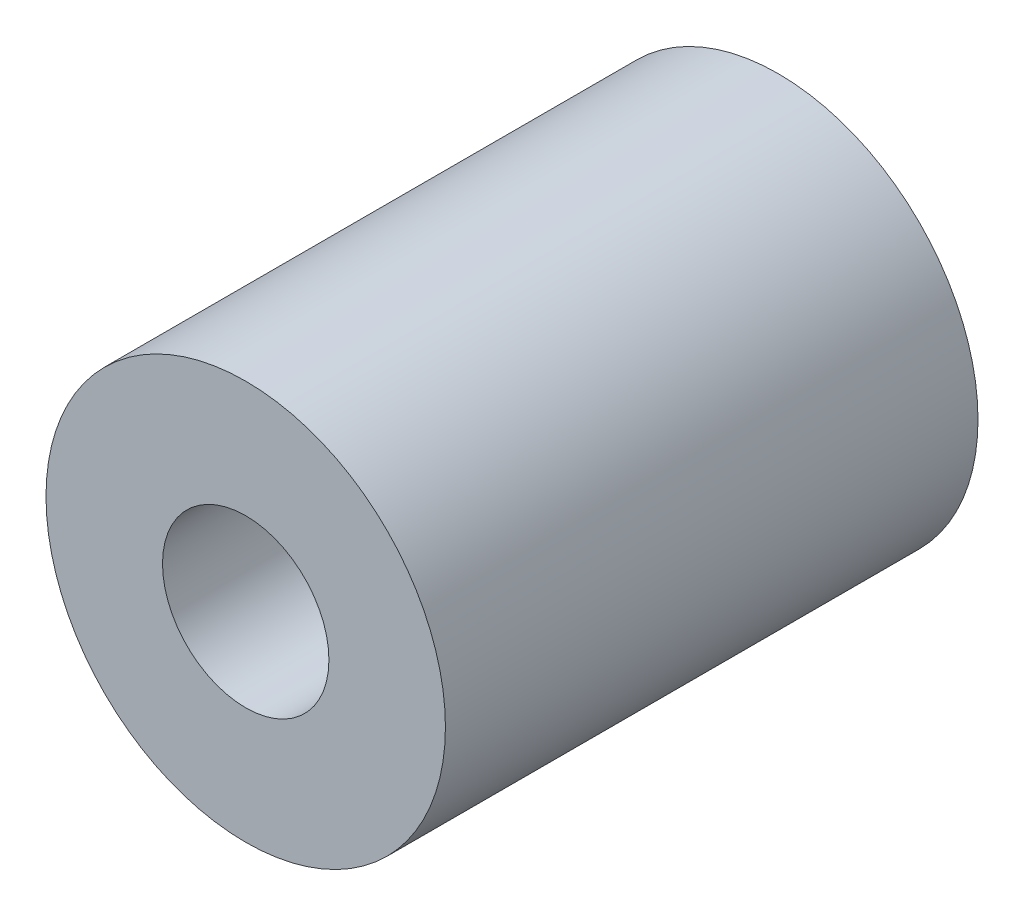
ISO-10303-21;
HEADER;
FILE_DESCRIPTION(('STEP AP214'),'2;1');
FILE_NAME('part.step','',(''),(''),'','','');
FILE_SCHEMA(('AUTOMOTIVE_DESIGN { 1 0 10303 214 1 1 1 1 }'));
ENDSEC;
DATA;
#1=APPLICATION_CONTEXT('core data for automotive mechanical design processes');
#2=APPLICATION_PROTOCOL_DEFINITION('international standard','automotive_design',2000,#1);
#3=PRODUCT_CONTEXT('',#1,'mechanical');
#4=PRODUCT('Part','Part','',(#3));
#5=PRODUCT_RELATED_PRODUCT_CATEGORY('part','',(#4));
#6=PRODUCT_DEFINITION_FORMATION('','',#4);
#7=PRODUCT_DEFINITION_CONTEXT('part definition',#1,'design');
#8=PRODUCT_DEFINITION('design','',#6,#7);
#9=PRODUCT_DEFINITION_SHAPE('','',#8);
#10=(LENGTH_UNIT() NAMED_UNIT(*) SI_UNIT(.MILLI.,.METRE.));
#11=(NAMED_UNIT(*) PLANE_ANGLE_UNIT() SI_UNIT($,.RADIAN.));
#12=(NAMED_UNIT(*) SI_UNIT($,.STERADIAN.) SOLID_ANGLE_UNIT());
#13=UNCERTAINTY_MEASURE_WITH_UNIT(LENGTH_MEASURE(1.E-05),#10,'distance_accuracy_value','');
#14=(GEOMETRIC_REPRESENTATION_CONTEXT(3) GLOBAL_UNCERTAINTY_ASSIGNED_CONTEXT((#13)) GLOBAL_UNIT_ASSIGNED_CONTEXT((#10,
#11,#12)) REPRESENTATION_CONTEXT('',''));
#15=CARTESIAN_POINT('',(0.,0.,0.));
#16=DIRECTION('',(0.,0.,1.));
#17=DIRECTION('',(1.,0.,0.));
#18=AXIS2_PLACEMENT_3D('',#15,#16,#17);
#19=CARTESIAN_POINT('',(0.,0.,20.32));
#20=DIRECTION('',(0.,0.,1.));
#21=DIRECTION('',(1.,0.,0.));
#22=AXIS2_PLACEMENT_3D('',#19,#20,#21);
#23=PLANE('',#22);
#24=CARTESIAN_POINT('',(0.,0.,20.32));
#25=DIRECTION('',(0.,0.,1.));
#26=DIRECTION('',(1.,0.,0.));
#27=AXIS2_PLACEMENT_3D('',#24,#25,#26);
#28=CIRCLE('',#27,7.62);
#29=CARTESIAN_POINT('',(7.62,0.,20.32));
#30=VERTEX_POINT('',#29);
#31=EDGE_CURVE('E10',#30,#30,#28,.T.);
#32=ORIENTED_EDGE('',*,*,#31,.T.);
#33=EDGE_LOOP('',(#32));
#34=FACE_BOUND('',#33,.T.);
#35=CARTESIAN_POINT('',(0.,0.,20.32));
#36=DIRECTION('',(0.,0.,1.));
#37=DIRECTION('',(1.,0.,0.));
#38=AXIS2_PLACEMENT_3D('',#35,#36,#37);
#39=CIRCLE('',#38,3.175);
#40=CARTESIAN_POINT('',(3.175,0.,20.32));
#41=VERTEX_POINT('',#40);
#42=EDGE_CURVE('E44',#41,#41,#39,.T.);
#43=ORIENTED_EDGE('',*,*,#42,.F.);
#44=EDGE_LOOP('',(#43));
#45=FACE_BOUND('',#44,.T.);
#46=ADVANCED_FACE('F33',(#34,#45),#23,.T.);
#47=CARTESIAN_POINT('',(0.,0.,0.));
#48=DIRECTION('',(0.,0.,1.));
#49=DIRECTION('',(1.,0.,0.));
#50=AXIS2_PLACEMENT_3D('',#47,#48,#49);
#51=PLANE('',#50);
#52=CARTESIAN_POINT('',(0.,0.,0.));
#53=DIRECTION('',(0.,0.,1.));
#54=DIRECTION('',(1.,0.,0.));
#55=AXIS2_PLACEMENT_3D('',#52,#53,#54);
#56=CIRCLE('',#55,7.62);
#57=CARTESIAN_POINT('',(7.62,0.,0.));
#58=VERTEX_POINT('',#57);
#59=EDGE_CURVE('E37',#58,#58,#56,.T.);
#60=ORIENTED_EDGE('',*,*,#59,.F.);
#61=EDGE_LOOP('',(#60));
#62=FACE_BOUND('',#61,.T.);
#63=CARTESIAN_POINT('',(0.,0.,0.));
#64=DIRECTION('',(0.,0.,1.));
#65=DIRECTION('',(1.,0.,0.));
#66=AXIS2_PLACEMENT_3D('',#63,#64,#65);
#67=CIRCLE('',#66,3.175);
#68=CARTESIAN_POINT('',(3.175,0.,0.));
#69=VERTEX_POINT('',#68);
#70=EDGE_CURVE('E46',#69,#69,#67,.T.);
#71=ORIENTED_EDGE('',*,*,#70,.T.);
#72=EDGE_LOOP('',(#71));
#73=FACE_BOUND('',#72,.T.);
#74=ADVANCED_FACE('F56',(#62,#73),#51,.F.);
#75=CARTESIAN_POINT('',(0.,0.,20.32));
#76=DIRECTION('',(0.,0.,-1.));
#77=DIRECTION('',(-1.,0.,0.));
#78=AXIS2_PLACEMENT_3D('',#75,#76,#77);
#79=CYLINDRICAL_SURFACE('',#78,7.62);
#80=ORIENTED_EDGE('',*,*,#31,.F.);
#81=EDGE_LOOP('',(#80));
#82=FACE_BOUND('',#81,.T.);
#83=ORIENTED_EDGE('',*,*,#59,.T.);
#84=EDGE_LOOP('',(#83));
#85=FACE_BOUND('',#84,.T.);
#86=ADVANCED_FACE('F35',(#82,#85),#79,.T.);
#87=CARTESIAN_POINT('',(0.,0.,20.32));
#88=DIRECTION('',(0.,0.,-1.));
#89=DIRECTION('',(-1.,0.,0.));
#90=AXIS2_PLACEMENT_3D('',#87,#88,#89);
#91=CYLINDRICAL_SURFACE('',#90,3.175);
#92=ORIENTED_EDGE('',*,*,#42,.T.);
#93=EDGE_LOOP('',(#92));
#94=FACE_BOUND('',#93,.T.);
#95=ORIENTED_EDGE('',*,*,#70,.F.);
#96=EDGE_LOOP('',(#95));
#97=FACE_BOUND('',#96,.T.);
#98=ADVANCED_FACE('F52',(#94,#97),#91,.F.);
#99=CLOSED_SHELL('',(#46,#74,#86,#98));
#100=MANIFOLD_SOLID_BREP('B2',#99);
#101=ADVANCED_BREP_SHAPE_REPRESENTATION('',(#18,#100),#14);
#102=SHAPE_DEFINITION_REPRESENTATION(#9,#101);
ENDSEC;
END-ISO-10303-21;
